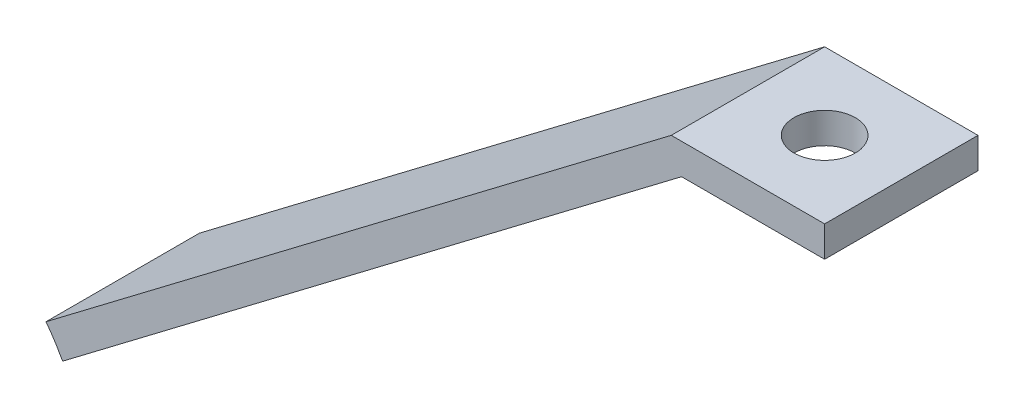
ISO-10303-21;
HEADER;
FILE_DESCRIPTION(('STEP AP214'),'2;1');
FILE_NAME('part.step','',(''),(''),'','','');
FILE_SCHEMA(('AUTOMOTIVE_DESIGN { 1 0 10303 214 1 1 1 1 }'));
ENDSEC;
DATA;
#1=APPLICATION_CONTEXT('core data for automotive mechanical design processes');
#2=APPLICATION_PROTOCOL_DEFINITION('international standard','automotive_design',2000,#1);
#3=PRODUCT_CONTEXT('',#1,'mechanical');
#4=PRODUCT('Part','Part','',(#3));
#5=PRODUCT_RELATED_PRODUCT_CATEGORY('part','',(#4));
#6=PRODUCT_DEFINITION_FORMATION('','',#4);
#7=PRODUCT_DEFINITION_CONTEXT('part definition',#1,'design');
#8=PRODUCT_DEFINITION('design','',#6,#7);
#9=PRODUCT_DEFINITION_SHAPE('','',#8);
#10=(LENGTH_UNIT() NAMED_UNIT(*) SI_UNIT(.MILLI.,.METRE.));
#11=(NAMED_UNIT(*) PLANE_ANGLE_UNIT() SI_UNIT($,.RADIAN.));
#12=(NAMED_UNIT(*) SI_UNIT($,.STERADIAN.) SOLID_ANGLE_UNIT());
#13=UNCERTAINTY_MEASURE_WITH_UNIT(LENGTH_MEASURE(1.E-05),#10,'distance_accuracy_value','');
#14=(GEOMETRIC_REPRESENTATION_CONTEXT(3) GLOBAL_UNCERTAINTY_ASSIGNED_CONTEXT((#13)) GLOBAL_UNIT_ASSIGNED_CONTEXT((#10,
#11,#12)) REPRESENTATION_CONTEXT('',''));
#15=CARTESIAN_POINT('',(0.,0.,0.));
#16=DIRECTION('',(0.,0.,1.));
#17=DIRECTION('',(1.,0.,0.));
#18=AXIS2_PLACEMENT_3D('',#15,#16,#17);
#19=CARTESIAN_POINT('',(920.,-317.717095457534,492.999346088971));
#20=CARTESIAN_POINT('',(895.,-317.717095457534,492.999346088971));
#21=CARTESIAN_POINT('',(895.,-343.729348358117,492.999346088971));
#22=CARTESIAN_POINT('',(920.,-343.729348358117,492.999346088971));
#23=CARTESIAN_POINT('',(945.,-343.729348358117,492.999346088971));
#24=CARTESIAN_POINT('',(945.,-317.717095457534,492.999346088971));
#25=CARTESIAN_POINT('',(920.,-317.717095457534,492.999346088971));
#26=(BOUNDED_CURVE() B_SPLINE_CURVE(3,(#19,#20,#21,#22,#23,#24,#25),.UNSPECIFIED.,.T.,
.F.) B_SPLINE_CURVE_WITH_KNOTS((4,3,4),(0.,0.5,1.),
.UNSPECIFIED.) CURVE() GEOMETRIC_REPRESENTATION_ITEM() RATIONAL_B_SPLINE_CURVE((1.,
0.333333333333333,0.333333333333333,1.,0.333333333333333,0.333333333333333,1.)) REPRESENTATION_ITEM(''));
#27=DIRECTION('',(0.,0.,1.));
#28=VECTOR('',#27,1.);
#29=SURFACE_OF_LINEAR_EXTRUSION('',#26,#28);
#30=CARTESIAN_POINT('',(920.,-317.717095457534,502.999346088971));
#31=CARTESIAN_POINT('',(895.,-317.717095457534,502.999346088971));
#32=CARTESIAN_POINT('',(895.,-343.729348358117,502.999346088971));
#33=CARTESIAN_POINT('',(920.,-343.729348358117,502.999346088971));
#34=CARTESIAN_POINT('',(945.,-343.729348358117,502.999346088971));
#35=CARTESIAN_POINT('',(945.,-317.717095457534,502.999346088971));
#36=CARTESIAN_POINT('',(920.,-317.717095457534,502.999346088971));
#37=(BOUNDED_CURVE() B_SPLINE_CURVE(3,(#30,#31,#32,#33,#34,#35,#36),.UNSPECIFIED.,.T.,
.F.) B_SPLINE_CURVE_WITH_KNOTS((4,3,4),(0.,0.5,1.),
.UNSPECIFIED.) CURVE() GEOMETRIC_REPRESENTATION_ITEM() RATIONAL_B_SPLINE_CURVE((1.,
0.333333333333333,0.333333333333333,1.,0.333333333333333,0.333333333333333,1.)) REPRESENTATION_ITEM(''));
#38=CARTESIAN_POINT('',(930.899175904757,-324.35511938797,502.999346088971));
#39=VERTEX_POINT('',#38);
#40=CARTESIAN_POINT('',(929.814034738548,-322.668005597386,502.999346088971));
#41=VERTEX_POINT('',#40);
#42=EDGE_CURVE('E121',#39,#41,#37,.T.);
#43=ORIENTED_EDGE('',*,*,#42,.T.);
#44=DIRECTION('',(0.,0.,1.));
#45=VECTOR('',#44,1.);
#46=CARTESIAN_POINT('',(929.814034738548,-322.668005597386,492.999346088971));
#47=LINE('',#46,#45);
#48=CARTESIAN_POINT('',(929.814034738548,-322.668005597386,492.999346088971));
#49=VERTEX_POINT('',#48);
#50=EDGE_CURVE('E11',#49,#41,#47,.T.);
#51=ORIENTED_EDGE('',*,*,#50,.F.);
#52=CARTESIAN_POINT('',(930.899175904757,-324.35511938797,492.999346088971));
#53=VERTEX_POINT('',#52);
#54=EDGE_CURVE('E137',#53,#49,#26,.T.);
#55=ORIENTED_EDGE('',*,*,#54,.F.);
#56=DIRECTION('',(0.,0.,1.));
#57=VECTOR('',#56,1.);
#58=CARTESIAN_POINT('',(930.899175904757,-324.35511938797,492.999346088971));
#59=LINE('',#58,#57);
#60=EDGE_CURVE('E117',#53,#39,#59,.T.);
#61=ORIENTED_EDGE('',*,*,#60,.T.);
#62=EDGE_LOOP('',(#43,#51,#55,#61));
#63=FACE_BOUND('',#62,.T.);
#64=ADVANCED_FACE('F36',(#63),#29,.F.);
#65=CARTESIAN_POINT('',(929.814034738548,-322.668005597386,492.999346088971));
#66=DIRECTION('',(0.604147112158245,-0.796872804700256,0.));
#67=DIRECTION('',(0.796872804700256,0.604147112158246,0.));
#68=AXIS2_PLACEMENT_3D('',#65,#66,#67);
#69=PLANE('',#68);
#70=DIRECTION('',(0.796872804700256,0.604147112158245,0.));
#71=VECTOR('',#70,1.);
#72=CARTESIAN_POINT('',(929.814034738548,-322.668005597386,502.999346088971));
#73=LINE('',#72,#71);
#74=CARTESIAN_POINT('',(970.58269303031,-291.759349876855,502.999346088971));
#75=VERTEX_POINT('',#74);
#76=EDGE_CURVE('E126',#41,#75,#73,.T.);
#77=ORIENTED_EDGE('',*,*,#76,.T.);
#78=DIRECTION('',(0.,0.,1.));
#79=VECTOR('',#78,1.);
#80=CARTESIAN_POINT('',(970.58269303031,-291.759349876855,492.999346088971));
#81=LINE('',#80,#79);
#82=CARTESIAN_POINT('',(970.58269303031,-291.759349876855,492.999346088971));
#83=VERTEX_POINT('',#82);
#84=EDGE_CURVE('E45',#83,#75,#81,.T.);
#85=ORIENTED_EDGE('',*,*,#84,.F.);
#86=DIRECTION('',(0.796872804700256,0.604147112158245,0.));
#87=VECTOR('',#86,1.);
#88=CARTESIAN_POINT('',(929.814034738548,-322.668005597386,492.999346088971));
#89=LINE('',#88,#87);
#90=EDGE_CURVE('E90',#49,#83,#89,.T.);
#91=ORIENTED_EDGE('',*,*,#90,.F.);
#92=ORIENTED_EDGE('',*,*,#50,.T.);
#93=EDGE_LOOP('',(#77,#85,#91,#92));
#94=FACE_BOUND('',#93,.T.);
#95=ADVANCED_FACE('F162',(#94),#69,.F.);
#96=CARTESIAN_POINT('',(970.58269303031,-291.759349876855,492.999346088971));
#97=DIRECTION('',(0.,-1.,0.));
#98=DIRECTION('',(0.,0.,-1.));
#99=AXIS2_PLACEMENT_3D('',#96,#97,#98);
#100=PLANE('',#99);
#101=CARTESIAN_POINT('',(975.58269303031,-291.759349876855,497.999346088971));
#102=DIRECTION('',(0.,-1.,0.));
#103=DIRECTION('',(0.,0.,-1.));
#104=AXIS2_PLACEMENT_3D('',#101,#102,#103);
#105=CIRCLE('',#104,2.);
#106=CARTESIAN_POINT('',(975.58269303031,-291.759349876855,495.999346088971));
#107=VERTEX_POINT('',#106);
#108=EDGE_CURVE('E127',#107,#107,#105,.T.);
#109=ORIENTED_EDGE('',*,*,#108,.T.);
#110=EDGE_LOOP('',(#109));
#111=FACE_BOUND('',#110,.T.);
#112=DIRECTION('',(1.,0.,0.));
#113=VECTOR('',#112,1.);
#114=CARTESIAN_POINT('',(970.58269303031,-291.759349876855,502.999346088971));
#115=LINE('',#114,#113);
#116=CARTESIAN_POINT('',(980.58269303031,-291.759349876855,502.999346088971));
#117=VERTEX_POINT('',#116);
#118=EDGE_CURVE('E132',#75,#117,#115,.T.);
#119=ORIENTED_EDGE('',*,*,#118,.T.);
#120=DIRECTION('',(0.,0.,1.));
#121=VECTOR('',#120,1.);
#122=CARTESIAN_POINT('',(980.58269303031,-291.759349876855,492.999346088971));
#123=LINE('',#122,#121);
#124=CARTESIAN_POINT('',(980.58269303031,-291.759349876855,492.999346088971));
#125=VERTEX_POINT('',#124);
#126=EDGE_CURVE('E112',#125,#117,#123,.T.);
#127=ORIENTED_EDGE('',*,*,#126,.F.);
#128=DIRECTION('',(1.,0.,0.));
#129=VECTOR('',#128,1.);
#130=CARTESIAN_POINT('',(970.58269303031,-291.759349876855,492.999346088971));
#131=LINE('',#130,#129);
#132=EDGE_CURVE('E103',#83,#125,#131,.T.);
#133=ORIENTED_EDGE('',*,*,#132,.F.);
#134=ORIENTED_EDGE('',*,*,#84,.T.);
#135=EDGE_LOOP('',(#119,#127,#133,#134));
#136=FACE_BOUND('',#135,.T.);
#137=ADVANCED_FACE('F143',(#111,#136),#100,.F.);
#138=CARTESIAN_POINT('',(980.58269303031,-291.759349876855,492.999346088971));
#139=DIRECTION('',(-1.,0.,0.));
#140=DIRECTION('',(0.,0.,1.));
#141=AXIS2_PLACEMENT_3D('',#138,#139,#140);
#142=PLANE('',#141);
#143=DIRECTION('',(0.,-1.,0.));
#144=VECTOR('',#143,1.);
#145=CARTESIAN_POINT('',(980.58269303031,-291.759349876855,502.999346088971));
#146=LINE('',#145,#144);
#147=CARTESIAN_POINT('',(980.58269303031,-293.759349876855,502.999346088971));
#148=VERTEX_POINT('',#147);
#149=EDGE_CURVE('E111',#117,#148,#146,.T.);
#150=ORIENTED_EDGE('',*,*,#149,.T.);
#151=DIRECTION('',(0.,0.,1.));
#152=VECTOR('',#151,1.);
#153=CARTESIAN_POINT('',(980.58269303031,-293.759349876855,492.999346088971));
#154=LINE('',#153,#152);
#155=CARTESIAN_POINT('',(980.58269303031,-293.759349876855,492.999346088971));
#156=VERTEX_POINT('',#155);
#157=EDGE_CURVE('E108',#156,#148,#154,.T.);
#158=ORIENTED_EDGE('',*,*,#157,.F.);
#159=DIRECTION('',(0.,-1.,0.));
#160=VECTOR('',#159,1.);
#161=CARTESIAN_POINT('',(980.58269303031,-291.759349876855,492.999346088971));
#162=LINE('',#161,#160);
#163=EDGE_CURVE('E97',#125,#156,#162,.T.);
#164=ORIENTED_EDGE('',*,*,#163,.F.);
#165=ORIENTED_EDGE('',*,*,#126,.T.);
#166=EDGE_LOOP('',(#150,#158,#164,#165));
#167=FACE_BOUND('',#166,.T.);
#168=ADVANCED_FACE('F109',(#167),#142,.F.);
#169=CARTESIAN_POINT('',(980.58269303031,-293.759349876855,492.999346088971));
#170=DIRECTION('',(0.,1.,0.));
#171=DIRECTION('',(0.,0.,1.));
#172=AXIS2_PLACEMENT_3D('',#169,#170,#171);
#173=PLANE('',#172);
#174=CARTESIAN_POINT('',(975.58269303031,-293.759349876855,497.999346088971));
#175=DIRECTION('',(0.,-1.,0.));
#176=DIRECTION('',(0.,0.,-1.));
#177=AXIS2_PLACEMENT_3D('',#174,#175,#176);
#178=CIRCLE('',#177,2.);
#179=CARTESIAN_POINT('',(975.58269303031,-293.759349876855,495.999346088971));
#180=VERTEX_POINT('',#179);
#181=EDGE_CURVE('E218',#180,#180,#178,.T.);
#182=ORIENTED_EDGE('',*,*,#181,.F.);
#183=EDGE_LOOP('',(#182));
#184=FACE_BOUND('',#183,.T.);
#185=DIRECTION('',(-1.,0.,0.));
#186=VECTOR('',#185,1.);
#187=CARTESIAN_POINT('',(980.58269303031,-293.759349876855,502.999346088971));
#188=LINE('',#187,#186);
#189=CARTESIAN_POINT('',(971.255135854953,-293.759349876855,502.999346088971));
#190=VERTEX_POINT('',#189);
#191=EDGE_CURVE('E76',#148,#190,#188,.T.);
#192=ORIENTED_EDGE('',*,*,#191,.T.);
#193=DIRECTION('',(0.,0.,1.));
#194=VECTOR('',#193,1.);
#195=CARTESIAN_POINT('',(971.255135854953,-293.759349876855,492.999346088971));
#196=LINE('',#195,#194);
#197=CARTESIAN_POINT('',(971.255135854953,-293.759349876855,492.999346088971));
#198=VERTEX_POINT('',#197);
#199=EDGE_CURVE('E113',#198,#190,#196,.T.);
#200=ORIENTED_EDGE('',*,*,#199,.F.);
#201=DIRECTION('',(-1.,0.,0.));
#202=VECTOR('',#201,1.);
#203=CARTESIAN_POINT('',(980.58269303031,-293.759349876855,492.999346088971));
#204=LINE('',#203,#202);
#205=EDGE_CURVE('E101',#156,#198,#204,.T.);
#206=ORIENTED_EDGE('',*,*,#205,.F.);
#207=ORIENTED_EDGE('',*,*,#157,.T.);
#208=EDGE_LOOP('',(#192,#200,#206,#207));
#209=FACE_BOUND('',#208,.T.);
#210=ADVANCED_FACE('F115',(#184,#209),#173,.F.);
#211=CARTESIAN_POINT('',(971.255135854953,-293.759349876855,492.999346088971));
#212=DIRECTION('',(-0.604147112158244,0.796872804700257,0.));
#213=DIRECTION('',(-0.796872804700257,-0.604147112158244,0.));
#214=AXIS2_PLACEMENT_3D('',#211,#212,#213);
#215=PLANE('',#214);
#216=DIRECTION('',(-0.796872804700257,-0.604147112158244,0.));
#217=VECTOR('',#216,1.);
#218=CARTESIAN_POINT('',(971.255135854953,-293.759349876855,502.999346088971));
#219=LINE('',#218,#217);
#220=EDGE_CURVE('E82',#190,#39,#219,.T.);
#221=ORIENTED_EDGE('',*,*,#220,.T.);
#222=ORIENTED_EDGE('',*,*,#60,.F.);
#223=DIRECTION('',(-0.796872804700257,-0.604147112158244,0.));
#224=VECTOR('',#223,1.);
#225=CARTESIAN_POINT('',(971.255135854953,-293.759349876855,492.999346088971));
#226=LINE('',#225,#224);
#227=EDGE_CURVE('E53',#198,#53,#226,.T.);
#228=ORIENTED_EDGE('',*,*,#227,.F.);
#229=ORIENTED_EDGE('',*,*,#199,.T.);
#230=EDGE_LOOP('',(#221,#222,#228,#229));
#231=FACE_BOUND('',#230,.T.);
#232=ADVANCED_FACE('F150',(#231),#215,.F.);
#233=CARTESIAN_POINT('',(920.,-343.729348358117,492.999346088971));
#234=DIRECTION('',(0.,0.,1.));
#235=DIRECTION('',(1.,0.,0.));
#236=AXIS2_PLACEMENT_3D('',#233,#234,#235);
#237=PLANE('',#236);
#238=ORIENTED_EDGE('',*,*,#54,.T.);
#239=ORIENTED_EDGE('',*,*,#90,.T.);
#240=ORIENTED_EDGE('',*,*,#132,.T.);
#241=ORIENTED_EDGE('',*,*,#163,.T.);
#242=ORIENTED_EDGE('',*,*,#205,.T.);
#243=ORIENTED_EDGE('',*,*,#227,.T.);
#244=EDGE_LOOP('',(#238,#239,#240,#241,#242,#243));
#245=FACE_BOUND('',#244,.T.);
#246=ADVANCED_FACE('F99',(#245),#237,.F.);
#247=CARTESIAN_POINT('',(920.,-343.729348358117,502.999346088971));
#248=DIRECTION('',(0.,0.,1.));
#249=DIRECTION('',(1.,0.,0.));
#250=AXIS2_PLACEMENT_3D('',#247,#248,#249);
#251=PLANE('',#250);
#252=ORIENTED_EDGE('',*,*,#42,.F.);
#253=ORIENTED_EDGE('',*,*,#220,.F.);
#254=ORIENTED_EDGE('',*,*,#191,.F.);
#255=ORIENTED_EDGE('',*,*,#149,.F.);
#256=ORIENTED_EDGE('',*,*,#118,.F.);
#257=ORIENTED_EDGE('',*,*,#76,.F.);
#258=EDGE_LOOP('',(#252,#253,#254,#255,#256,#257));
#259=FACE_BOUND('',#258,.T.);
#260=ADVANCED_FACE('F146',(#259),#251,.T.);
#261=CARTESIAN_POINT('',(975.58269303031,-283.759349876855,497.999346088971));
#262=DIRECTION('',(0.,-1.,0.));
#263=DIRECTION('',(0.,0.,-1.));
#264=AXIS2_PLACEMENT_3D('',#261,#262,#263);
#265=CYLINDRICAL_SURFACE('',#264,2.);
#266=ORIENTED_EDGE('',*,*,#181,.T.);
#267=EDGE_LOOP('',(#266));
#268=FACE_BOUND('',#267,.T.);
#269=ORIENTED_EDGE('',*,*,#108,.F.);
#270=EDGE_LOOP('',(#269));
#271=FACE_BOUND('',#270,.T.);
#272=ADVANCED_FACE('F191',(#268,#271),#265,.F.);
#273=CLOSED_SHELL('',(#64,#95,#137,#168,#210,#232,#246,#260,#272));
#274=MANIFOLD_SOLID_BREP('B2',#273);
#275=ADVANCED_BREP_SHAPE_REPRESENTATION('',(#18,#274),#14);
#276=SHAPE_DEFINITION_REPRESENTATION(#9,#275);
ENDSEC;
END-ISO-10303-21;
